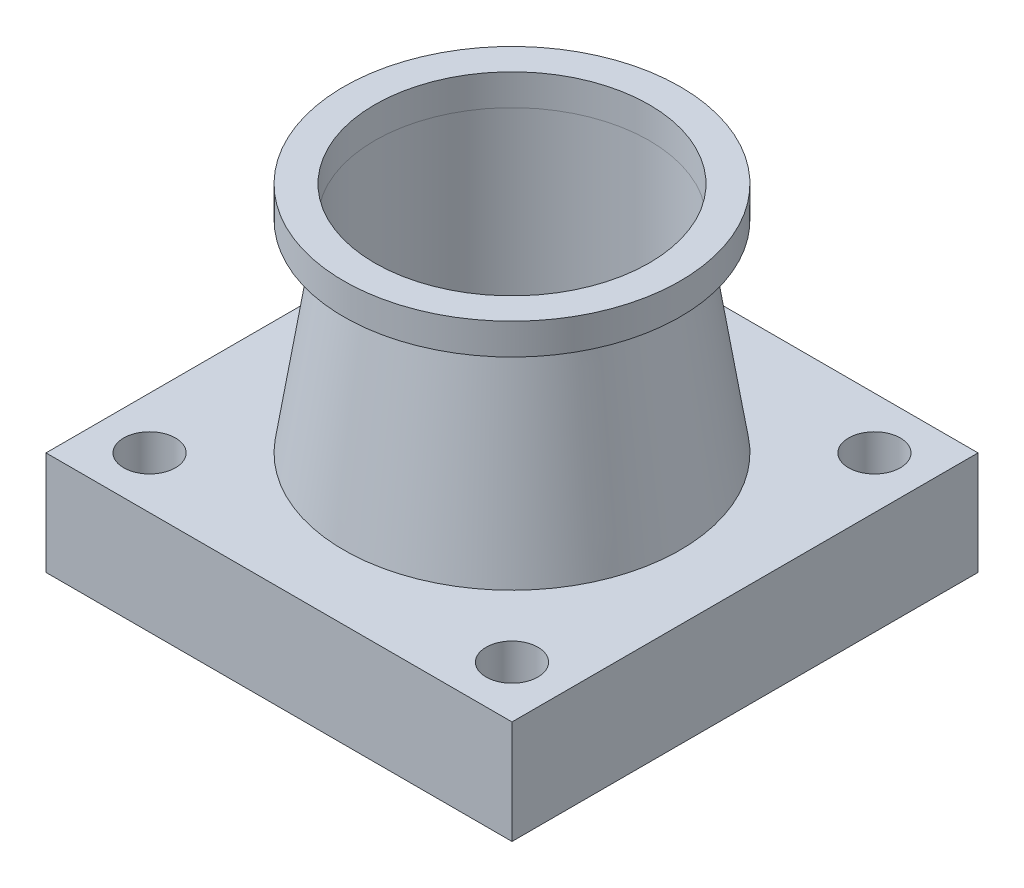
ISO-10303-21;
HEADER;
FILE_DESCRIPTION(('STEP AP214'),'2;1');
FILE_NAME('part.step','',(''),(''),'','','');
FILE_SCHEMA(('AUTOMOTIVE_DESIGN { 1 0 10303 214 1 1 1 1 }'));
ENDSEC;
DATA;
#1=APPLICATION_CONTEXT('core data for automotive mechanical design processes');
#2=APPLICATION_PROTOCOL_DEFINITION('international standard','automotive_design',2000,#1);
#3=PRODUCT_CONTEXT('',#1,'mechanical');
#4=PRODUCT('Part','Part','',(#3));
#5=PRODUCT_RELATED_PRODUCT_CATEGORY('part','',(#4));
#6=PRODUCT_DEFINITION_FORMATION('','',#4);
#7=PRODUCT_DEFINITION_CONTEXT('part definition',#1,'design');
#8=PRODUCT_DEFINITION('design','',#6,#7);
#9=PRODUCT_DEFINITION_SHAPE('','',#8);
#10=(LENGTH_UNIT() NAMED_UNIT(*) SI_UNIT(.MILLI.,.METRE.));
#11=(NAMED_UNIT(*) PLANE_ANGLE_UNIT() SI_UNIT($,.RADIAN.));
#12=(NAMED_UNIT(*) SI_UNIT($,.STERADIAN.) SOLID_ANGLE_UNIT());
#13=UNCERTAINTY_MEASURE_WITH_UNIT(LENGTH_MEASURE(1.E-05),#10,'distance_accuracy_value','');
#14=(GEOMETRIC_REPRESENTATION_CONTEXT(3) GLOBAL_UNCERTAINTY_ASSIGNED_CONTEXT((#13)) GLOBAL_UNIT_ASSIGNED_CONTEXT((#10,
#11,#12)) REPRESENTATION_CONTEXT('',''));
#15=CARTESIAN_POINT('',(0.,0.,0.));
#16=DIRECTION('',(0.,0.,1.));
#17=DIRECTION('',(1.,0.,0.));
#18=AXIS2_PLACEMENT_3D('',#15,#16,#17);
#19=CARTESIAN_POINT('',(45.,20.,45.));
#20=DIRECTION('',(-1.,0.,0.));
#21=DIRECTION('',(0.,0.,1.));
#22=AXIS2_PLACEMENT_3D('',#19,#20,#21);
#23=PLANE('',#22);
#24=DIRECTION('',(0.,0.,-1.));
#25=VECTOR('',#24,1.);
#26=CARTESIAN_POINT('',(45.,0.,45.));
#27=LINE('',#26,#25);
#28=CARTESIAN_POINT('',(45.,0.,45.));
#29=VERTEX_POINT('',#28);
#30=CARTESIAN_POINT('',(45.,0.,-45.));
#31=VERTEX_POINT('',#30);
#32=EDGE_CURVE('E107',#29,#31,#27,.T.);
#33=ORIENTED_EDGE('',*,*,#32,.T.);
#34=DIRECTION('',(0.,-1.,0.));
#35=VECTOR('',#34,1.);
#36=CARTESIAN_POINT('',(45.,20.,-45.));
#37=LINE('',#36,#35);
#38=CARTESIAN_POINT('',(45.,20.,-45.));
#39=VERTEX_POINT('',#38);
#40=EDGE_CURVE('E94',#39,#31,#37,.T.);
#41=ORIENTED_EDGE('',*,*,#40,.F.);
#42=DIRECTION('',(0.,0.,-1.));
#43=VECTOR('',#42,1.);
#44=CARTESIAN_POINT('',(45.,20.,45.));
#45=LINE('',#44,#43);
#46=CARTESIAN_POINT('',(45.,20.,45.));
#47=VERTEX_POINT('',#46);
#48=EDGE_CURVE('E114',#47,#39,#45,.T.);
#49=ORIENTED_EDGE('',*,*,#48,.F.);
#50=DIRECTION('',(0.,-1.,0.));
#51=VECTOR('',#50,1.);
#52=CARTESIAN_POINT('',(45.,20.,45.));
#53=LINE('',#52,#51);
#54=EDGE_CURVE('E96',#47,#29,#53,.T.);
#55=ORIENTED_EDGE('',*,*,#54,.T.);
#56=EDGE_LOOP('',(#33,#41,#49,#55));
#57=FACE_BOUND('',#56,.T.);
#58=ADVANCED_FACE('F40',(#57),#23,.F.);
#59=CARTESIAN_POINT('',(-45.,20.,-45.));
#60=DIRECTION('',(0.,0.,1.));
#61=DIRECTION('',(1.,0.,0.));
#62=AXIS2_PLACEMENT_3D('',#59,#60,#61);
#63=PLANE('',#62);
#64=DIRECTION('',(-1.,0.,0.));
#65=VECTOR('',#64,1.);
#66=CARTESIAN_POINT('',(-45.,0.,-45.));
#67=LINE('',#66,#65);
#68=CARTESIAN_POINT('',(-45.,0.,-45.));
#69=VERTEX_POINT('',#68);
#70=EDGE_CURVE('E57',#31,#69,#67,.T.);
#71=ORIENTED_EDGE('',*,*,#70,.T.);
#72=DIRECTION('',(0.,-1.,0.));
#73=VECTOR('',#72,1.);
#74=CARTESIAN_POINT('',(-45.,20.,-45.));
#75=LINE('',#74,#73);
#76=CARTESIAN_POINT('',(-45.,20.,-45.));
#77=VERTEX_POINT('',#76);
#78=EDGE_CURVE('E91',#77,#69,#75,.T.);
#79=ORIENTED_EDGE('',*,*,#78,.F.);
#80=DIRECTION('',(-1.,0.,0.));
#81=VECTOR('',#80,1.);
#82=CARTESIAN_POINT('',(-45.,20.,-45.));
#83=LINE('',#82,#81);
#84=EDGE_CURVE('E73',#39,#77,#83,.T.);
#85=ORIENTED_EDGE('',*,*,#84,.F.);
#86=ORIENTED_EDGE('',*,*,#40,.T.);
#87=EDGE_LOOP('',(#71,#79,#85,#86));
#88=FACE_BOUND('',#87,.T.);
#89=ADVANCED_FACE('F90',(#88),#63,.F.);
#90=CARTESIAN_POINT('',(-45.,20.,45.));
#91=DIRECTION('',(1.,0.,0.));
#92=DIRECTION('',(0.,0.,-1.));
#93=AXIS2_PLACEMENT_3D('',#90,#91,#92);
#94=PLANE('',#93);
#95=DIRECTION('',(0.,0.,1.));
#96=VECTOR('',#95,1.);
#97=CARTESIAN_POINT('',(-45.,0.,45.));
#98=LINE('',#97,#96);
#99=CARTESIAN_POINT('',(-45.,0.,45.));
#100=VERTEX_POINT('',#99);
#101=EDGE_CURVE('E88',#69,#100,#98,.T.);
#102=ORIENTED_EDGE('',*,*,#101,.T.);
#103=DIRECTION('',(0.,-1.,0.));
#104=VECTOR('',#103,1.);
#105=CARTESIAN_POINT('',(-45.,20.,45.));
#106=LINE('',#105,#104);
#107=CARTESIAN_POINT('',(-45.,20.,45.));
#108=VERTEX_POINT('',#107);
#109=EDGE_CURVE('E118',#108,#100,#106,.T.);
#110=ORIENTED_EDGE('',*,*,#109,.F.);
#111=DIRECTION('',(0.,0.,1.));
#112=VECTOR('',#111,1.);
#113=CARTESIAN_POINT('',(-45.,20.,45.));
#114=LINE('',#113,#112);
#115=EDGE_CURVE('E99',#77,#108,#114,.T.);
#116=ORIENTED_EDGE('',*,*,#115,.F.);
#117=ORIENTED_EDGE('',*,*,#78,.T.);
#118=EDGE_LOOP('',(#102,#110,#116,#117));
#119=FACE_BOUND('',#118,.T.);
#120=ADVANCED_FACE('F98',(#119),#94,.F.);
#121=CARTESIAN_POINT('',(-45.,20.,45.));
#122=DIRECTION('',(0.,0.,-1.));
#123=DIRECTION('',(-1.,0.,0.));
#124=AXIS2_PLACEMENT_3D('',#121,#122,#123);
#125=PLANE('',#124);
#126=DIRECTION('',(1.,0.,0.));
#127=VECTOR('',#126,1.);
#128=CARTESIAN_POINT('',(-45.,0.,45.));
#129=LINE('',#128,#127);
#130=EDGE_CURVE('E82',#100,#29,#129,.T.);
#131=ORIENTED_EDGE('',*,*,#130,.T.);
#132=ORIENTED_EDGE('',*,*,#54,.F.);
#133=DIRECTION('',(1.,0.,0.));
#134=VECTOR('',#133,1.);
#135=CARTESIAN_POINT('',(-45.,20.,45.));
#136=LINE('',#135,#134);
#137=EDGE_CURVE('E110',#108,#47,#136,.T.);
#138=ORIENTED_EDGE('',*,*,#137,.F.);
#139=ORIENTED_EDGE('',*,*,#109,.T.);
#140=EDGE_LOOP('',(#131,#132,#138,#139));
#141=FACE_BOUND('',#140,.T.);
#142=ADVANCED_FACE('F125',(#141),#125,.F.);
#143=CARTESIAN_POINT('',(0.,20.,0.));
#144=DIRECTION('',(0.,-1.,0.));
#145=DIRECTION('',(0.,0.,-1.));
#146=AXIS2_PLACEMENT_3D('',#143,#144,#145);
#147=PLANE('',#146);
#148=CARTESIAN_POINT('',(-35.,20.,-35.));
#149=DIRECTION('',(0.,1.,0.));
#150=DIRECTION('',(0.,0.,1.));
#151=AXIS2_PLACEMENT_3D('',#148,#149,#150);
#152=CIRCLE('',#151,5.);
#153=CARTESIAN_POINT('',(-35.,20.,-30.));
#154=VERTEX_POINT('',#153);
#155=EDGE_CURVE('E241',#154,#154,#152,.T.);
#156=ORIENTED_EDGE('',*,*,#155,.F.);
#157=EDGE_LOOP('',(#156));
#158=FACE_BOUND('',#157,.T.);
#159=CARTESIAN_POINT('',(35.,20.,-35.));
#160=DIRECTION('',(0.,1.,0.));
#161=DIRECTION('',(0.,0.,1.));
#162=AXIS2_PLACEMENT_3D('',#159,#160,#161);
#163=CIRCLE('',#162,5.);
#164=CARTESIAN_POINT('',(35.,20.,-30.));
#165=VERTEX_POINT('',#164);
#166=EDGE_CURVE('E243',#165,#165,#163,.T.);
#167=ORIENTED_EDGE('',*,*,#166,.F.);
#168=EDGE_LOOP('',(#167));
#169=FACE_BOUND('',#168,.T.);
#170=CARTESIAN_POINT('',(35.,20.,35.));
#171=DIRECTION('',(0.,1.,0.));
#172=DIRECTION('',(0.,0.,1.));
#173=AXIS2_PLACEMENT_3D('',#170,#171,#172);
#174=CIRCLE('',#173,5.);
#175=CARTESIAN_POINT('',(35.,20.,40.));
#176=VERTEX_POINT('',#175);
#177=EDGE_CURVE('E249',#176,#176,#174,.T.);
#178=ORIENTED_EDGE('',*,*,#177,.F.);
#179=EDGE_LOOP('',(#178));
#180=FACE_BOUND('',#179,.T.);
#181=CARTESIAN_POINT('',(-35.,20.,35.));
#182=DIRECTION('',(0.,1.,0.));
#183=DIRECTION('',(0.,0.,1.));
#184=AXIS2_PLACEMENT_3D('',#181,#182,#183);
#185=CIRCLE('',#184,5.);
#186=CARTESIAN_POINT('',(-35.,20.,40.));
#187=VERTEX_POINT('',#186);
#188=EDGE_CURVE('E255',#187,#187,#185,.T.);
#189=ORIENTED_EDGE('',*,*,#188,.F.);
#190=EDGE_LOOP('',(#189));
#191=FACE_BOUND('',#190,.T.);
#192=CARTESIAN_POINT('',(0.,20.,0.));
#193=DIRECTION('',(0.,-1.,0.));
#194=DIRECTION('',(0.,0.,-1.));
#195=AXIS2_PLACEMENT_3D('',#192,#193,#194);
#196=CIRCLE('',#195,32.5);
#197=CARTESIAN_POINT('',(0.,20.,-32.5));
#198=VERTEX_POINT('',#197);
#199=EDGE_CURVE('E116',#198,#198,#196,.T.);
#200=ORIENTED_EDGE('',*,*,#199,.T.);
#201=EDGE_LOOP('',(#200));
#202=FACE_BOUND('',#201,.T.);
#203=ORIENTED_EDGE('',*,*,#48,.T.);
#204=ORIENTED_EDGE('',*,*,#84,.T.);
#205=ORIENTED_EDGE('',*,*,#115,.T.);
#206=ORIENTED_EDGE('',*,*,#137,.T.);
#207=EDGE_LOOP('',(#203,#204,#205,#206));
#208=FACE_BOUND('',#207,.T.);
#209=ADVANCED_FACE('F126',(#158,#169,#180,#191,#202,#208),#147,.F.);
#210=CARTESIAN_POINT('',(0.,0.,0.));
#211=DIRECTION('',(0.,-1.,0.));
#212=DIRECTION('',(0.,0.,-1.));
#213=AXIS2_PLACEMENT_3D('',#210,#211,#212);
#214=PLANE('',#213);
#215=CARTESIAN_POINT('',(-35.,0.,-35.));
#216=DIRECTION('',(0.,1.,0.));
#217=DIRECTION('',(0.,0.,1.));
#218=AXIS2_PLACEMENT_3D('',#215,#216,#217);
#219=CIRCLE('',#218,5.);
#220=CARTESIAN_POINT('',(-35.,0.,-30.));
#221=VERTEX_POINT('',#220);
#222=EDGE_CURVE('E239',#221,#221,#219,.T.);
#223=ORIENTED_EDGE('',*,*,#222,.T.);
#224=EDGE_LOOP('',(#223));
#225=FACE_BOUND('',#224,.T.);
#226=CARTESIAN_POINT('',(35.,0.,-35.));
#227=DIRECTION('',(0.,1.,0.));
#228=DIRECTION('',(0.,0.,1.));
#229=AXIS2_PLACEMENT_3D('',#226,#227,#228);
#230=CIRCLE('',#229,5.);
#231=CARTESIAN_POINT('',(35.,0.,-30.));
#232=VERTEX_POINT('',#231);
#233=EDGE_CURVE('E246',#232,#232,#230,.T.);
#234=ORIENTED_EDGE('',*,*,#233,.T.);
#235=EDGE_LOOP('',(#234));
#236=FACE_BOUND('',#235,.T.);
#237=CARTESIAN_POINT('',(35.,0.,35.));
#238=DIRECTION('',(0.,1.,0.));
#239=DIRECTION('',(0.,0.,1.));
#240=AXIS2_PLACEMENT_3D('',#237,#238,#239);
#241=CIRCLE('',#240,5.);
#242=CARTESIAN_POINT('',(35.,0.,40.));
#243=VERTEX_POINT('',#242);
#244=EDGE_CURVE('E252',#243,#243,#241,.T.);
#245=ORIENTED_EDGE('',*,*,#244,.T.);
#246=EDGE_LOOP('',(#245));
#247=FACE_BOUND('',#246,.T.);
#248=CARTESIAN_POINT('',(-35.,0.,35.));
#249=DIRECTION('',(0.,1.,0.));
#250=DIRECTION('',(0.,0.,1.));
#251=AXIS2_PLACEMENT_3D('',#248,#249,#250);
#252=CIRCLE('',#251,5.);
#253=CARTESIAN_POINT('',(-35.,0.,40.));
#254=VERTEX_POINT('',#253);
#255=EDGE_CURVE('E109',#254,#254,#252,.T.);
#256=ORIENTED_EDGE('',*,*,#255,.T.);
#257=EDGE_LOOP('',(#256));
#258=FACE_BOUND('',#257,.T.);
#259=ORIENTED_EDGE('',*,*,#32,.F.);
#260=ORIENTED_EDGE('',*,*,#130,.F.);
#261=ORIENTED_EDGE('',*,*,#101,.F.);
#262=ORIENTED_EDGE('',*,*,#70,.F.);
#263=EDGE_LOOP('',(#259,#260,#261,#262));
#264=FACE_BOUND('',#263,.T.);
#265=ADVANCED_FACE('F101',(#225,#236,#247,#258,#264),#214,.T.);
#266=CARTESIAN_POINT('',(0.,20.,0.));
#267=DIRECTION('',(0.,-1.,0.));
#268=DIRECTION('',(0.,0.,-1.));
#269=AXIS2_PLACEMENT_3D('',#266,#267,#268);
#270=CONICAL_SURFACE('',#269,32.5,0.152649328395265);
#271=CARTESIAN_POINT('',(0.,59.,0.));
#272=DIRECTION('',(0.,-1.,0.));
#273=DIRECTION('',(0.,0.,-1.));
#274=AXIS2_PLACEMENT_3D('',#271,#272,#273);
#275=CIRCLE('',#274,26.5);
#276=CARTESIAN_POINT('',(0.,59.,-26.5));
#277=VERTEX_POINT('',#276);
#278=EDGE_CURVE('E44',#277,#277,#275,.F.);
#279=ORIENTED_EDGE('',*,*,#278,.F.);
#280=EDGE_LOOP('',(#279));
#281=FACE_BOUND('',#280,.T.);
#282=ORIENTED_EDGE('',*,*,#199,.F.);
#283=EDGE_LOOP('',(#282));
#284=FACE_BOUND('',#283,.T.);
#285=ADVANCED_FACE('F134',(#281,#284),#270,.T.);
#286=CARTESIAN_POINT('',(0.,-54.953318805774,0.));
#287=DIRECTION('',(0.,1.,0.));
#288=DIRECTION('',(0.,0.,1.));
#289=AXIS2_PLACEMENT_3D('',#286,#287,#288);
#290=CYLINDRICAL_SURFACE('',#289,26.5);
#291=ORIENTED_EDGE('',*,*,#278,.T.);
#292=EDGE_LOOP('',(#291));
#293=FACE_BOUND('',#292,.T.);
#294=CARTESIAN_POINT('',(0.,20.,0.));
#295=DIRECTION('',(0.,-1.,0.));
#296=DIRECTION('',(0.,0.,-1.));
#297=AXIS2_PLACEMENT_3D('',#294,#295,#296);
#298=CIRCLE('',#297,26.5);
#299=CARTESIAN_POINT('',(0.,20.,-26.5));
#300=VERTEX_POINT('',#299);
#301=EDGE_CURVE('E12',#300,#300,#298,.F.);
#302=ORIENTED_EDGE('',*,*,#301,.F.);
#303=EDGE_LOOP('',(#302));
#304=FACE_BOUND('',#303,.T.);
#305=ADVANCED_FACE('F42',(#293,#304),#290,.F.);
#306=CARTESIAN_POINT('',(0.,20.,0.));
#307=DIRECTION('',(0.,-1.,0.));
#308=DIRECTION('',(0.,0.,-1.));
#309=AXIS2_PLACEMENT_3D('',#306,#307,#308);
#310=PLANE('',#309);
#311=ORIENTED_EDGE('',*,*,#301,.T.);
#312=EDGE_LOOP('',(#311));
#313=FACE_BOUND('',#312,.T.);
#314=ADVANCED_FACE('F179',(#313),#310,.F.);
#315=CARTESIAN_POINT('',(-35.,0.,35.));
#316=DIRECTION('',(0.,1.,0.));
#317=DIRECTION('',(0.,0.,1.));
#318=AXIS2_PLACEMENT_3D('',#315,#316,#317);
#319=CYLINDRICAL_SURFACE('',#318,5.);
#320=ORIENTED_EDGE('',*,*,#255,.F.);
#321=EDGE_LOOP('',(#320));
#322=FACE_BOUND('',#321,.T.);
#323=ORIENTED_EDGE('',*,*,#188,.T.);
#324=EDGE_LOOP('',(#323));
#325=FACE_BOUND('',#324,.T.);
#326=ADVANCED_FACE('F148',(#322,#325),#319,.F.);
#327=CARTESIAN_POINT('',(35.,0.,35.));
#328=DIRECTION('',(0.,1.,0.));
#329=DIRECTION('',(0.,0.,1.));
#330=AXIS2_PLACEMENT_3D('',#327,#328,#329);
#331=CYLINDRICAL_SURFACE('',#330,5.);
#332=ORIENTED_EDGE('',*,*,#244,.F.);
#333=EDGE_LOOP('',(#332));
#334=FACE_BOUND('',#333,.T.);
#335=ORIENTED_EDGE('',*,*,#177,.T.);
#336=EDGE_LOOP('',(#335));
#337=FACE_BOUND('',#336,.T.);
#338=ADVANCED_FACE('F204',(#334,#337),#331,.F.);
#339=CARTESIAN_POINT('',(35.,0.,-35.));
#340=DIRECTION('',(0.,1.,0.));
#341=DIRECTION('',(0.,0.,1.));
#342=AXIS2_PLACEMENT_3D('',#339,#340,#341);
#343=CYLINDRICAL_SURFACE('',#342,5.);
#344=ORIENTED_EDGE('',*,*,#233,.F.);
#345=EDGE_LOOP('',(#344));
#346=FACE_BOUND('',#345,.T.);
#347=ORIENTED_EDGE('',*,*,#166,.T.);
#348=EDGE_LOOP('',(#347));
#349=FACE_BOUND('',#348,.T.);
#350=ADVANCED_FACE('F213',(#346,#349),#343,.F.);
#351=CARTESIAN_POINT('',(-35.,0.,-35.));
#352=DIRECTION('',(0.,1.,0.));
#353=DIRECTION('',(0.,0.,1.));
#354=AXIS2_PLACEMENT_3D('',#351,#352,#353);
#355=CYLINDRICAL_SURFACE('',#354,5.);
#356=ORIENTED_EDGE('',*,*,#222,.F.);
#357=EDGE_LOOP('',(#356));
#358=FACE_BOUND('',#357,.T.);
#359=ORIENTED_EDGE('',*,*,#155,.T.);
#360=EDGE_LOOP('',(#359));
#361=FACE_BOUND('',#360,.T.);
#362=ADVANCED_FACE('F222',(#358,#361),#355,.F.);
#363=CLOSED_SHELL('',(#58,#89,#120,#142,#209,#265,#285,#305,#314,#326,#338,#350,#362));
#364=MANIFOLD_SOLID_BREP('B2',#363);
#365=CARTESIAN_POINT('',(0.,65.,0.));
#366=DIRECTION('',(0.,1.,0.));
#367=DIRECTION('',(0.,0.,1.));
#368=AXIS2_PLACEMENT_3D('',#365,#366,#367);
#369=PLANE('',#368);
#370=CARTESIAN_POINT('',(0.,65.,0.));
#371=DIRECTION('',(0.,1.,0.));
#372=DIRECTION('',(0.,0.,1.));
#373=AXIS2_PLACEMENT_3D('',#370,#371,#372);
#374=CIRCLE('',#373,26.5);
#375=CARTESIAN_POINT('',(0.,65.,26.5));
#376=VERTEX_POINT('',#375);
#377=EDGE_CURVE('E305',#376,#376,#374,.T.);
#378=ORIENTED_EDGE('',*,*,#377,.F.);
#379=EDGE_LOOP('',(#378));
#380=FACE_BOUND('',#379,.T.);
#381=CARTESIAN_POINT('',(0.,65.,0.));
#382=DIRECTION('',(0.,-1.,0.));
#383=DIRECTION('',(0.,0.,-1.));
#384=AXIS2_PLACEMENT_3D('',#381,#382,#383);
#385=CIRCLE('',#384,32.5);
#386=CARTESIAN_POINT('',(0.,65.,-32.5));
#387=VERTEX_POINT('',#386);
#388=EDGE_CURVE('E295',#387,#387,#385,.T.);
#389=ORIENTED_EDGE('',*,*,#388,.F.);
#390=EDGE_LOOP('',(#389));
#391=FACE_BOUND('',#390,.T.);
#392=ADVANCED_FACE('F292',(#380,#391),#369,.T.);
#393=CARTESIAN_POINT('',(0.,20.,0.));
#394=DIRECTION('',(0.,-1.,0.));
#395=DIRECTION('',(0.,0.,-1.));
#396=AXIS2_PLACEMENT_3D('',#393,#394,#395);
#397=CYLINDRICAL_SURFACE('',#396,32.5);
#398=ORIENTED_EDGE('',*,*,#388,.T.);
#399=EDGE_LOOP('',(#398));
#400=FACE_BOUND('',#399,.T.);
#401=CARTESIAN_POINT('',(0.,59.,0.));
#402=DIRECTION('',(0.,-1.,0.));
#403=DIRECTION('',(0.,0.,-1.));
#404=AXIS2_PLACEMENT_3D('',#401,#402,#403);
#405=CIRCLE('',#404,32.5);
#406=CARTESIAN_POINT('',(0.,59.,-32.5));
#407=VERTEX_POINT('',#406);
#408=EDGE_CURVE('E303',#407,#407,#405,.T.);
#409=ORIENTED_EDGE('',*,*,#408,.F.);
#410=EDGE_LOOP('',(#409));
#411=FACE_BOUND('',#410,.T.);
#412=ADVANCED_FACE('F317',(#400,#411),#397,.T.);
#413=CARTESIAN_POINT('',(0.,59.,-32.5));
#414=DIRECTION('',(0.,-1.,0.));
#415=DIRECTION('',(0.,0.,-1.));
#416=AXIS2_PLACEMENT_3D('',#413,#414,#415);
#417=PLANE('',#416);
#418=ORIENTED_EDGE('',*,*,#408,.T.);
#419=EDGE_LOOP('',(#418));
#420=FACE_BOUND('',#419,.T.);
#421=CARTESIAN_POINT('',(0.,59.,0.));
#422=DIRECTION('',(0.,-1.,0.));
#423=DIRECTION('',(0.,0.,-1.));
#424=AXIS2_PLACEMENT_3D('',#421,#422,#423);
#425=CIRCLE('',#424,26.5);
#426=CARTESIAN_POINT('',(0.,59.,-26.5));
#427=VERTEX_POINT('',#426);
#428=EDGE_CURVE('E39',#427,#427,#425,.F.);
#429=ORIENTED_EDGE('',*,*,#428,.T.);
#430=EDGE_LOOP('',(#429));
#431=FACE_BOUND('',#430,.T.);
#432=ADVANCED_FACE('F322',(#420,#431),#417,.T.);
#433=CARTESIAN_POINT('',(0.,-54.953318805774,0.));
#434=DIRECTION('',(0.,1.,0.));
#435=DIRECTION('',(0.,0.,1.));
#436=AXIS2_PLACEMENT_3D('',#433,#434,#435);
#437=CYLINDRICAL_SURFACE('',#436,26.5);
#438=ORIENTED_EDGE('',*,*,#377,.T.);
#439=EDGE_LOOP('',(#438));
#440=FACE_BOUND('',#439,.T.);
#441=ORIENTED_EDGE('',*,*,#428,.F.);
#442=EDGE_LOOP('',(#441));
#443=FACE_BOUND('',#442,.T.);
#444=ADVANCED_FACE('F312',(#440,#443),#437,.F.);
#445=CLOSED_SHELL('',(#392,#412,#432,#444));
#446=MANIFOLD_SOLID_BREP('B6',#445);
#447=ADVANCED_BREP_SHAPE_REPRESENTATION('',(#18,#364,#446),#14);
#448=SHAPE_DEFINITION_REPRESENTATION(#9,#447);
ENDSEC;
END-ISO-10303-21;
